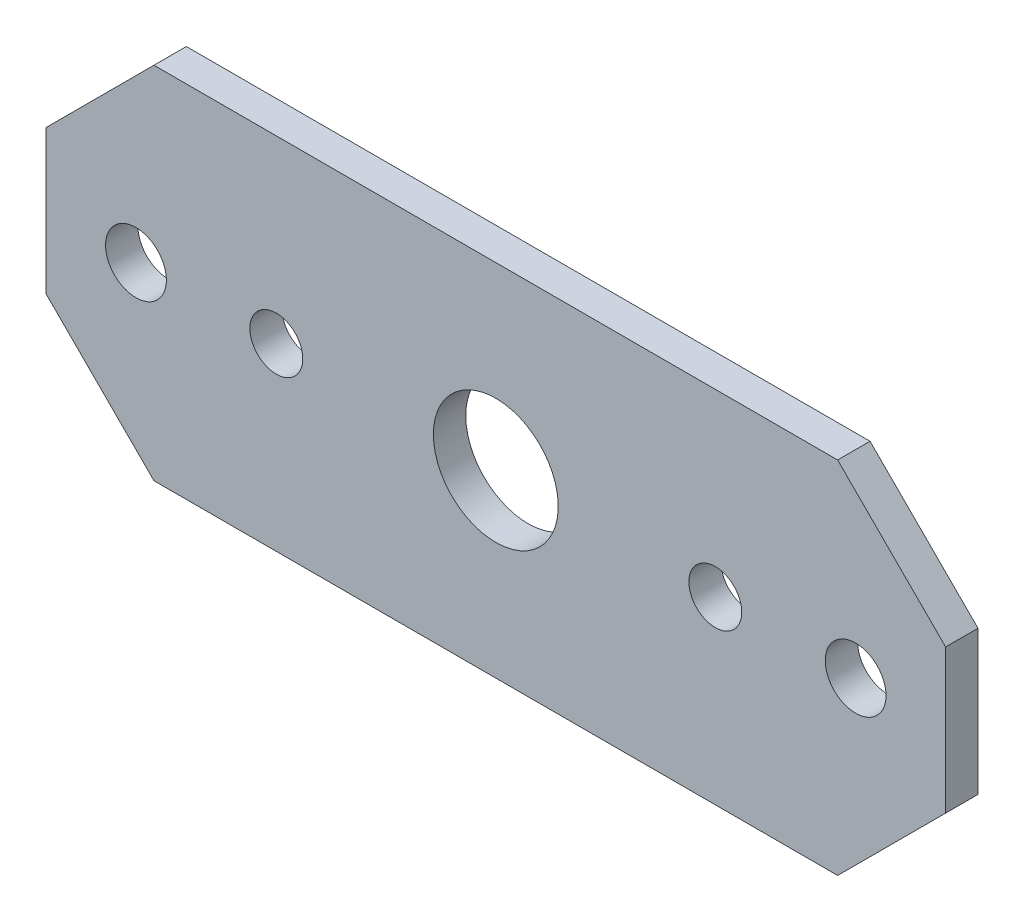
ISO-10303-21;
HEADER;
FILE_DESCRIPTION(('STEP AP214'),'2;1');
FILE_NAME('part.step','',(''),(''),'','','');
FILE_SCHEMA(('AUTOMOTIVE_DESIGN { 1 0 10303 214 1 1 1 1 }'));
ENDSEC;
DATA;
#1=APPLICATION_CONTEXT('core data for automotive mechanical design processes');
#2=APPLICATION_PROTOCOL_DEFINITION('international standard','automotive_design',2000,#1);
#3=PRODUCT_CONTEXT('',#1,'mechanical');
#4=PRODUCT('Part','Part','',(#3));
#5=PRODUCT_RELATED_PRODUCT_CATEGORY('part','',(#4));
#6=PRODUCT_DEFINITION_FORMATION('','',#4);
#7=PRODUCT_DEFINITION_CONTEXT('part definition',#1,'design');
#8=PRODUCT_DEFINITION('design','',#6,#7);
#9=PRODUCT_DEFINITION_SHAPE('','',#8);
#10=(LENGTH_UNIT() NAMED_UNIT(*) SI_UNIT(.MILLI.,.METRE.));
#11=(NAMED_UNIT(*) PLANE_ANGLE_UNIT() SI_UNIT($,.RADIAN.));
#12=(NAMED_UNIT(*) SI_UNIT($,.STERADIAN.) SOLID_ANGLE_UNIT());
#13=UNCERTAINTY_MEASURE_WITH_UNIT(LENGTH_MEASURE(1.E-05),#10,'distance_accuracy_value','');
#14=(GEOMETRIC_REPRESENTATION_CONTEXT(3) GLOBAL_UNCERTAINTY_ASSIGNED_CONTEXT((#13)) GLOBAL_UNIT_ASSIGNED_CONTEXT((#10,
#11,#12)) REPRESENTATION_CONTEXT('',''));
#15=CARTESIAN_POINT('',(0.,0.,0.));
#16=DIRECTION('',(0.,0.,1.));
#17=DIRECTION('',(1.,0.,0.));
#18=AXIS2_PLACEMENT_3D('',#15,#16,#17);
#19=CARTESIAN_POINT('',(-31.75,12.7,-2.286));
#20=DIRECTION('',(0.,0.,-1.));
#21=DIRECTION('',(1.,0.,0.));
#22=AXIS2_PLACEMENT_3D('',#19,#20,#21);
#23=PLANE('',#22);
#24=DIRECTION('',(1.,0.,0.));
#25=VECTOR('',#24,1.);
#26=CARTESIAN_POINT('',(-31.75,12.7,-2.286));
#27=LINE('',#26,#25);
#28=CARTESIAN_POINT('',(24.13,12.7,-2.286));
#29=VERTEX_POINT('',#28);
#30=CARTESIAN_POINT('',(-24.13,12.7,-2.286));
#31=VERTEX_POINT('',#30);
#32=EDGE_CURVE('E258',#29,#31,#27,.F.);
#33=ORIENTED_EDGE('',*,*,#32,.F.);
#34=DIRECTION('',(0.707106781186548,-0.707106781186547,0.));
#35=VECTOR('',#34,1.);
#36=CARTESIAN_POINT('',(24.13,12.7,-2.286));
#37=LINE('',#36,#35);
#38=CARTESIAN_POINT('',(31.75,5.07999999999999,-2.286));
#39=VERTEX_POINT('',#38);
#40=EDGE_CURVE('E124',#39,#29,#37,.F.);
#41=ORIENTED_EDGE('',*,*,#40,.F.);
#42=DIRECTION('',(0.,1.,0.));
#43=VECTOR('',#42,1.);
#44=CARTESIAN_POINT('',(31.75,12.7,-2.286));
#45=LINE('',#44,#43);
#46=CARTESIAN_POINT('',(31.75,-5.07999999999999,-2.286));
#47=VERTEX_POINT('',#46);
#48=EDGE_CURVE('E105',#47,#39,#45,.T.);
#49=ORIENTED_EDGE('',*,*,#48,.F.);
#50=DIRECTION('',(-0.707106781186548,-0.707106781186547,0.));
#51=VECTOR('',#50,1.);
#52=CARTESIAN_POINT('',(31.75,-5.07999999999999,-2.286));
#53=LINE('',#52,#51);
#54=CARTESIAN_POINT('',(24.13,-12.7,-2.286));
#55=VERTEX_POINT('',#54);
#56=EDGE_CURVE('E112',#55,#47,#53,.F.);
#57=ORIENTED_EDGE('',*,*,#56,.F.);
#58=DIRECTION('',(-1.,0.,0.));
#59=VECTOR('',#58,1.);
#60=CARTESIAN_POINT('',(-31.75,-12.7,-2.286));
#61=LINE('',#60,#59);
#62=CARTESIAN_POINT('',(-24.13,-12.7,-2.286));
#63=VERTEX_POINT('',#62);
#64=EDGE_CURVE('E145',#63,#55,#61,.F.);
#65=ORIENTED_EDGE('',*,*,#64,.F.);
#66=DIRECTION('',(-0.707106781186547,0.707106781186548,0.));
#67=VECTOR('',#66,1.);
#68=CARTESIAN_POINT('',(-24.13,-12.7,-2.286));
#69=LINE('',#68,#67);
#70=CARTESIAN_POINT('',(-31.75,-5.08,-2.286));
#71=VERTEX_POINT('',#70);
#72=EDGE_CURVE('E239',#71,#63,#69,.F.);
#73=ORIENTED_EDGE('',*,*,#72,.F.);
#74=DIRECTION('',(0.,1.,0.));
#75=VECTOR('',#74,1.);
#76=CARTESIAN_POINT('',(-31.75,12.7,-2.286));
#77=LINE('',#76,#75);
#78=CARTESIAN_POINT('',(-31.75,5.08,-2.286));
#79=VERTEX_POINT('',#78);
#80=EDGE_CURVE('E248',#79,#71,#77,.F.);
#81=ORIENTED_EDGE('',*,*,#80,.F.);
#82=DIRECTION('',(0.707106781186547,0.707106781186548,0.));
#83=VECTOR('',#82,1.);
#84=CARTESIAN_POINT('',(-31.75,5.08,-2.286));
#85=LINE('',#84,#83);
#86=EDGE_CURVE('E253',#31,#79,#85,.F.);
#87=ORIENTED_EDGE('',*,*,#86,.F.);
#88=EDGE_LOOP('',(#33,#41,#49,#57,#65,#73,#81,#87));
#89=FACE_BOUND('',#88,.T.);
#90=CARTESIAN_POINT('',(0.,0.,-2.286));
#91=DIRECTION('',(0.,0.,-1.));
#92=DIRECTION('',(-1.,0.,0.));
#93=AXIS2_PLACEMENT_3D('',#90,#91,#92);
#94=CIRCLE('',#93,4.4069);
#95=CARTESIAN_POINT('',(-4.4069,0.,-2.286));
#96=VERTEX_POINT('',#95);
#97=EDGE_CURVE('E120',#96,#96,#94,.T.);
#98=ORIENTED_EDGE('',*,*,#97,.F.);
#99=EDGE_LOOP('',(#98));
#100=FACE_BOUND('',#99,.T.);
#101=CARTESIAN_POINT('',(25.4,0.,-2.286));
#102=DIRECTION('',(0.,0.,-1.));
#103=DIRECTION('',(-1.,0.,0.));
#104=AXIS2_PLACEMENT_3D('',#101,#102,#103);
#105=CIRCLE('',#104,2.1463);
#106=CARTESIAN_POINT('',(23.2537,0.,-2.286));
#107=VERTEX_POINT('',#106);
#108=EDGE_CURVE('E148',#107,#107,#105,.T.);
#109=ORIENTED_EDGE('',*,*,#108,.F.);
#110=EDGE_LOOP('',(#109));
#111=FACE_BOUND('',#110,.T.);
#112=CARTESIAN_POINT('',(-25.4,0.,-2.286));
#113=DIRECTION('',(0.,0.,-1.));
#114=DIRECTION('',(-1.,0.,0.));
#115=AXIS2_PLACEMENT_3D('',#112,#113,#114);
#116=CIRCLE('',#115,2.1463);
#117=CARTESIAN_POINT('',(-27.5463,0.,-2.286));
#118=VERTEX_POINT('',#117);
#119=EDGE_CURVE('E151',#118,#118,#116,.T.);
#120=ORIENTED_EDGE('',*,*,#119,.F.);
#121=EDGE_LOOP('',(#120));
#122=FACE_BOUND('',#121,.T.);
#123=CARTESIAN_POINT('',(15.494,0.,-2.286));
#124=DIRECTION('',(0.,0.,-1.));
#125=DIRECTION('',(-1.,0.,0.));
#126=AXIS2_PLACEMENT_3D('',#123,#124,#125);
#127=CIRCLE('',#126,1.8669);
#128=CARTESIAN_POINT('',(13.6271,0.,-2.286));
#129=VERTEX_POINT('',#128);
#130=EDGE_CURVE('E153',#129,#129,#127,.T.);
#131=ORIENTED_EDGE('',*,*,#130,.F.);
#132=EDGE_LOOP('',(#131));
#133=FACE_BOUND('',#132,.T.);
#134=CARTESIAN_POINT('',(-15.494,0.,-2.286));
#135=DIRECTION('',(0.,0.,-1.));
#136=DIRECTION('',(-1.,0.,0.));
#137=AXIS2_PLACEMENT_3D('',#134,#135,#136);
#138=CIRCLE('',#137,1.8669);
#139=CARTESIAN_POINT('',(-17.3609,0.,-2.286));
#140=VERTEX_POINT('',#139);
#141=EDGE_CURVE('E40',#140,#140,#138,.T.);
#142=ORIENTED_EDGE('',*,*,#141,.F.);
#143=EDGE_LOOP('',(#142));
#144=FACE_BOUND('',#143,.T.);
#145=ADVANCED_FACE('F37',(#89,#100,#111,#122,#133,#144),#23,.T.);
#146=CARTESIAN_POINT('',(-15.494,0.,-2.286));
#147=DIRECTION('',(0.,0.,1.));
#148=DIRECTION('',(-1.,0.,0.));
#149=AXIS2_PLACEMENT_3D('',#146,#147,#148);
#150=CYLINDRICAL_SURFACE('',#149,1.8669);
#151=ORIENTED_EDGE('',*,*,#141,.T.);
#152=EDGE_LOOP('',(#151));
#153=FACE_BOUND('',#152,.T.);
#154=CARTESIAN_POINT('',(-15.494,0.,0.));
#155=DIRECTION('',(0.,0.,-1.));
#156=DIRECTION('',(-1.,0.,0.));
#157=AXIS2_PLACEMENT_3D('',#154,#155,#156);
#158=CIRCLE('',#157,1.8669);
#159=CARTESIAN_POINT('',(-17.3609,0.,0.));
#160=VERTEX_POINT('',#159);
#161=EDGE_CURVE('E142',#160,#160,#158,.T.);
#162=ORIENTED_EDGE('',*,*,#161,.F.);
#163=EDGE_LOOP('',(#162));
#164=FACE_BOUND('',#163,.T.);
#165=ADVANCED_FACE('F160',(#153,#164),#150,.F.);
#166=CARTESIAN_POINT('',(15.494,0.,-2.286));
#167=DIRECTION('',(0.,0.,1.));
#168=DIRECTION('',(-1.,0.,0.));
#169=AXIS2_PLACEMENT_3D('',#166,#167,#168);
#170=CYLINDRICAL_SURFACE('',#169,1.8669);
#171=ORIENTED_EDGE('',*,*,#130,.T.);
#172=EDGE_LOOP('',(#171));
#173=FACE_BOUND('',#172,.T.);
#174=CARTESIAN_POINT('',(15.494,0.,0.));
#175=DIRECTION('',(0.,0.,-1.));
#176=DIRECTION('',(-1.,0.,0.));
#177=AXIS2_PLACEMENT_3D('',#174,#175,#176);
#178=CIRCLE('',#177,1.8669);
#179=CARTESIAN_POINT('',(13.6271,0.,0.));
#180=VERTEX_POINT('',#179);
#181=EDGE_CURVE('E139',#180,#180,#178,.T.);
#182=ORIENTED_EDGE('',*,*,#181,.F.);
#183=EDGE_LOOP('',(#182));
#184=FACE_BOUND('',#183,.T.);
#185=ADVANCED_FACE('F167',(#173,#184),#170,.F.);
#186=CARTESIAN_POINT('',(-25.4,0.,-2.286));
#187=DIRECTION('',(0.,0.,1.));
#188=DIRECTION('',(-1.,0.,0.));
#189=AXIS2_PLACEMENT_3D('',#186,#187,#188);
#190=CYLINDRICAL_SURFACE('',#189,2.1463);
#191=ORIENTED_EDGE('',*,*,#119,.T.);
#192=EDGE_LOOP('',(#191));
#193=FACE_BOUND('',#192,.T.);
#194=CARTESIAN_POINT('',(-25.4,0.,0.));
#195=DIRECTION('',(0.,0.,-1.));
#196=DIRECTION('',(-1.,0.,0.));
#197=AXIS2_PLACEMENT_3D('',#194,#195,#196);
#198=CIRCLE('',#197,2.1463);
#199=CARTESIAN_POINT('',(-27.5463,0.,0.));
#200=VERTEX_POINT('',#199);
#201=EDGE_CURVE('E136',#200,#200,#198,.T.);
#202=ORIENTED_EDGE('',*,*,#201,.F.);
#203=EDGE_LOOP('',(#202));
#204=FACE_BOUND('',#203,.T.);
#205=ADVANCED_FACE('F171',(#193,#204),#190,.F.);
#206=CARTESIAN_POINT('',(25.4,0.,-2.286));
#207=DIRECTION('',(0.,0.,1.));
#208=DIRECTION('',(-1.,0.,0.));
#209=AXIS2_PLACEMENT_3D('',#206,#207,#208);
#210=CYLINDRICAL_SURFACE('',#209,2.1463);
#211=ORIENTED_EDGE('',*,*,#108,.T.);
#212=EDGE_LOOP('',(#211));
#213=FACE_BOUND('',#212,.T.);
#214=CARTESIAN_POINT('',(25.4,0.,0.));
#215=DIRECTION('',(0.,0.,-1.));
#216=DIRECTION('',(-1.,0.,0.));
#217=AXIS2_PLACEMENT_3D('',#214,#215,#216);
#218=CIRCLE('',#217,2.1463);
#219=CARTESIAN_POINT('',(23.2537,0.,0.));
#220=VERTEX_POINT('',#219);
#221=EDGE_CURVE('E133',#220,#220,#218,.T.);
#222=ORIENTED_EDGE('',*,*,#221,.F.);
#223=EDGE_LOOP('',(#222));
#224=FACE_BOUND('',#223,.T.);
#225=ADVANCED_FACE('F176',(#213,#224),#210,.F.);
#226=CARTESIAN_POINT('',(0.,0.,-2.286));
#227=DIRECTION('',(0.,0.,1.));
#228=DIRECTION('',(-1.,0.,0.));
#229=AXIS2_PLACEMENT_3D('',#226,#227,#228);
#230=CYLINDRICAL_SURFACE('',#229,4.4069);
#231=ORIENTED_EDGE('',*,*,#97,.T.);
#232=EDGE_LOOP('',(#231));
#233=FACE_BOUND('',#232,.T.);
#234=CARTESIAN_POINT('',(0.,0.,0.));
#235=DIRECTION('',(0.,0.,-1.));
#236=DIRECTION('',(-1.,0.,0.));
#237=AXIS2_PLACEMENT_3D('',#234,#235,#236);
#238=CIRCLE('',#237,4.4069);
#239=CARTESIAN_POINT('',(-4.4069,0.,0.));
#240=VERTEX_POINT('',#239);
#241=EDGE_CURVE('E129',#240,#240,#238,.T.);
#242=ORIENTED_EDGE('',*,*,#241,.F.);
#243=EDGE_LOOP('',(#242));
#244=FACE_BOUND('',#243,.T.);
#245=ADVANCED_FACE('F180',(#233,#244),#230,.F.);
#246=CARTESIAN_POINT('',(31.75,-5.07999999999999,-2.286));
#247=DIRECTION('',(-0.707106781186547,0.707106781186548,0.));
#248=DIRECTION('',(-0.707106781186548,-0.707106781186547,0.));
#249=AXIS2_PLACEMENT_3D('',#246,#247,#248);
#250=PLANE('',#249);
#251=DIRECTION('',(0.,0.,-1.));
#252=VECTOR('',#251,1.);
#253=CARTESIAN_POINT('',(24.13,-12.7,-2.286));
#254=LINE('',#253,#252);
#255=CARTESIAN_POINT('',(24.13,-12.7,0.));
#256=VERTEX_POINT('',#255);
#257=EDGE_CURVE('E116',#55,#256,#254,.F.);
#258=ORIENTED_EDGE('',*,*,#257,.F.);
#259=ORIENTED_EDGE('',*,*,#56,.T.);
#260=DIRECTION('',(0.,0.,-1.));
#261=VECTOR('',#260,1.);
#262=CARTESIAN_POINT('',(31.75,-5.07999999999999,-2.286));
#263=LINE('',#262,#261);
#264=CARTESIAN_POINT('',(31.75,-5.07999999999999,0.));
#265=VERTEX_POINT('',#264);
#266=EDGE_CURVE('E101',#265,#47,#263,.T.);
#267=ORIENTED_EDGE('',*,*,#266,.F.);
#268=DIRECTION('',(0.707106781186548,0.707106781186547,0.));
#269=VECTOR('',#268,1.);
#270=CARTESIAN_POINT('',(24.13,-12.7,0.));
#271=LINE('',#270,#269);
#272=EDGE_CURVE('E132',#256,#265,#271,.T.);
#273=ORIENTED_EDGE('',*,*,#272,.F.);
#274=EDGE_LOOP('',(#258,#259,#267,#273));
#275=FACE_BOUND('',#274,.T.);
#276=ADVANCED_FACE('F115',(#275),#250,.F.);
#277=CARTESIAN_POINT('',(31.75,12.7,-2.286));
#278=DIRECTION('',(-1.,0.,0.));
#279=DIRECTION('',(0.,0.,-1.));
#280=AXIS2_PLACEMENT_3D('',#277,#278,#279);
#281=PLANE('',#280);
#282=ORIENTED_EDGE('',*,*,#266,.T.);
#283=ORIENTED_EDGE('',*,*,#48,.T.);
#284=DIRECTION('',(0.,0.,-1.));
#285=VECTOR('',#284,1.);
#286=CARTESIAN_POINT('',(31.75,5.08,-2.286));
#287=LINE('',#286,#285);
#288=CARTESIAN_POINT('',(31.75,5.08,0.));
#289=VERTEX_POINT('',#288);
#290=EDGE_CURVE('E96',#289,#39,#287,.T.);
#291=ORIENTED_EDGE('',*,*,#290,.F.);
#292=DIRECTION('',(0.,1.,0.));
#293=VECTOR('',#292,1.);
#294=CARTESIAN_POINT('',(31.75,12.7,0.));
#295=LINE('',#294,#293);
#296=EDGE_CURVE('E108',#265,#289,#295,.T.);
#297=ORIENTED_EDGE('',*,*,#296,.F.);
#298=EDGE_LOOP('',(#282,#283,#291,#297));
#299=FACE_BOUND('',#298,.T.);
#300=ADVANCED_FACE('F103',(#299),#281,.F.);
#301=CARTESIAN_POINT('',(24.13,12.7,-2.286));
#302=DIRECTION('',(-0.707106781186547,-0.707106781186548,0.));
#303=DIRECTION('',(0.707106781186548,-0.707106781186547,0.));
#304=AXIS2_PLACEMENT_3D('',#301,#302,#303);
#305=PLANE('',#304);
#306=ORIENTED_EDGE('',*,*,#290,.T.);
#307=ORIENTED_EDGE('',*,*,#40,.T.);
#308=DIRECTION('',(0.,0.,1.));
#309=VECTOR('',#308,1.);
#310=CARTESIAN_POINT('',(24.13,12.7,-2.286));
#311=LINE('',#310,#309);
#312=CARTESIAN_POINT('',(24.13,12.7,0.));
#313=VERTEX_POINT('',#312);
#314=EDGE_CURVE('E261',#313,#29,#311,.F.);
#315=ORIENTED_EDGE('',*,*,#314,.F.);
#316=DIRECTION('',(-0.707106781186548,0.707106781186547,0.));
#317=VECTOR('',#316,1.);
#318=CARTESIAN_POINT('',(31.75,5.08,0.));
#319=LINE('',#318,#317);
#320=EDGE_CURVE('E270',#289,#313,#319,.T.);
#321=ORIENTED_EDGE('',*,*,#320,.F.);
#322=EDGE_LOOP('',(#306,#307,#315,#321));
#323=FACE_BOUND('',#322,.T.);
#324=ADVANCED_FACE('F189',(#323),#305,.F.);
#325=CARTESIAN_POINT('',(-31.75,12.7,-2.286));
#326=DIRECTION('',(0.,-1.,0.));
#327=DIRECTION('',(0.,0.,1.));
#328=AXIS2_PLACEMENT_3D('',#325,#326,#327);
#329=PLANE('',#328);
#330=ORIENTED_EDGE('',*,*,#314,.T.);
#331=ORIENTED_EDGE('',*,*,#32,.T.);
#332=DIRECTION('',(0.,0.,-1.));
#333=VECTOR('',#332,1.);
#334=CARTESIAN_POINT('',(-24.13,12.7,-2.286));
#335=LINE('',#334,#333);
#336=CARTESIAN_POINT('',(-24.13,12.7,0.));
#337=VERTEX_POINT('',#336);
#338=EDGE_CURVE('E256',#337,#31,#335,.T.);
#339=ORIENTED_EDGE('',*,*,#338,.F.);
#340=DIRECTION('',(1.,0.,0.));
#341=VECTOR('',#340,1.);
#342=CARTESIAN_POINT('',(-31.75,12.7,0.));
#343=LINE('',#342,#341);
#344=EDGE_CURVE('E267',#313,#337,#343,.F.);
#345=ORIENTED_EDGE('',*,*,#344,.F.);
#346=EDGE_LOOP('',(#330,#331,#339,#345));
#347=FACE_BOUND('',#346,.T.);
#348=ADVANCED_FACE('F192',(#347),#329,.F.);
#349=CARTESIAN_POINT('',(-31.75,5.08,-2.286));
#350=DIRECTION('',(0.707106781186548,-0.707106781186547,0.));
#351=DIRECTION('',(0.707106781186547,0.707106781186548,0.));
#352=AXIS2_PLACEMENT_3D('',#349,#350,#351);
#353=PLANE('',#352);
#354=ORIENTED_EDGE('',*,*,#338,.T.);
#355=ORIENTED_EDGE('',*,*,#86,.T.);
#356=DIRECTION('',(0.,0.,1.));
#357=VECTOR('',#356,1.);
#358=CARTESIAN_POINT('',(-31.75,5.08,-2.286));
#359=LINE('',#358,#357);
#360=CARTESIAN_POINT('',(-31.75,5.08,0.));
#361=VERTEX_POINT('',#360);
#362=EDGE_CURVE('E251',#361,#79,#359,.F.);
#363=ORIENTED_EDGE('',*,*,#362,.F.);
#364=DIRECTION('',(-0.707106781186547,-0.707106781186548,0.));
#365=VECTOR('',#364,1.);
#366=CARTESIAN_POINT('',(-24.13,12.7,0.));
#367=LINE('',#366,#365);
#368=EDGE_CURVE('E269',#337,#361,#367,.T.);
#369=ORIENTED_EDGE('',*,*,#368,.F.);
#370=EDGE_LOOP('',(#354,#355,#363,#369));
#371=FACE_BOUND('',#370,.T.);
#372=ADVANCED_FACE('F195',(#371),#353,.F.);
#373=CARTESIAN_POINT('',(-31.75,12.7,-2.286));
#374=DIRECTION('',(1.,0.,0.));
#375=DIRECTION('',(0.,0.,1.));
#376=AXIS2_PLACEMENT_3D('',#373,#374,#375);
#377=PLANE('',#376);
#378=DIRECTION('',(0.,0.,-1.));
#379=VECTOR('',#378,1.);
#380=CARTESIAN_POINT('',(-31.75,-5.08,-2.286));
#381=LINE('',#380,#379);
#382=CARTESIAN_POINT('',(-31.75,-5.08,0.));
#383=VERTEX_POINT('',#382);
#384=EDGE_CURVE('E246',#383,#71,#381,.T.);
#385=ORIENTED_EDGE('',*,*,#384,.F.);
#386=DIRECTION('',(0.,1.,0.));
#387=VECTOR('',#386,1.);
#388=CARTESIAN_POINT('',(-31.75,12.7,0.));
#389=LINE('',#388,#387);
#390=EDGE_CURVE('E233',#361,#383,#389,.F.);
#391=ORIENTED_EDGE('',*,*,#390,.F.);
#392=ORIENTED_EDGE('',*,*,#362,.T.);
#393=ORIENTED_EDGE('',*,*,#80,.T.);
#394=EDGE_LOOP('',(#385,#391,#392,#393));
#395=FACE_BOUND('',#394,.T.);
#396=ADVANCED_FACE('F199',(#395),#377,.F.);
#397=CARTESIAN_POINT('',(-24.13,-12.7,-2.286));
#398=DIRECTION('',(0.707106781186548,0.707106781186547,0.));
#399=DIRECTION('',(-0.707106781186547,0.707106781186548,0.));
#400=AXIS2_PLACEMENT_3D('',#397,#398,#399);
#401=PLANE('',#400);
#402=ORIENTED_EDGE('',*,*,#384,.T.);
#403=ORIENTED_EDGE('',*,*,#72,.T.);
#404=DIRECTION('',(0.,0.,-1.));
#405=VECTOR('',#404,1.);
#406=CARTESIAN_POINT('',(-24.13,-12.7,-2.286));
#407=LINE('',#406,#405);
#408=CARTESIAN_POINT('',(-24.13,-12.7,0.));
#409=VERTEX_POINT('',#408);
#410=EDGE_CURVE('E237',#409,#63,#407,.T.);
#411=ORIENTED_EDGE('',*,*,#410,.F.);
#412=DIRECTION('',(0.707106781186547,-0.707106781186548,0.));
#413=VECTOR('',#412,1.);
#414=CARTESIAN_POINT('',(-31.75,-5.08,0.));
#415=LINE('',#414,#413);
#416=EDGE_CURVE('E46',#383,#409,#415,.T.);
#417=ORIENTED_EDGE('',*,*,#416,.F.);
#418=EDGE_LOOP('',(#402,#403,#411,#417));
#419=FACE_BOUND('',#418,.T.);
#420=ADVANCED_FACE('F203',(#419),#401,.F.);
#421=CARTESIAN_POINT('',(-31.75,-12.7,-2.286));
#422=DIRECTION('',(0.,1.,0.));
#423=DIRECTION('',(-1.,0.,0.));
#424=AXIS2_PLACEMENT_3D('',#421,#422,#423);
#425=PLANE('',#424);
#426=ORIENTED_EDGE('',*,*,#410,.T.);
#427=ORIENTED_EDGE('',*,*,#64,.T.);
#428=ORIENTED_EDGE('',*,*,#257,.T.);
#429=DIRECTION('',(1.,0.,0.));
#430=VECTOR('',#429,1.);
#431=CARTESIAN_POINT('',(-31.75,-12.7,0.));
#432=LINE('',#431,#430);
#433=EDGE_CURVE('E11',#409,#256,#432,.T.);
#434=ORIENTED_EDGE('',*,*,#433,.F.);
#435=EDGE_LOOP('',(#426,#427,#428,#434));
#436=FACE_BOUND('',#435,.T.);
#437=ADVANCED_FACE('F207',(#436),#425,.F.);
#438=CARTESIAN_POINT('',(-31.75,12.7,0.));
#439=DIRECTION('',(0.,0.,-1.));
#440=DIRECTION('',(1.,0.,0.));
#441=AXIS2_PLACEMENT_3D('',#438,#439,#440);
#442=PLANE('',#441);
#443=ORIENTED_EDGE('',*,*,#416,.T.);
#444=ORIENTED_EDGE('',*,*,#433,.T.);
#445=ORIENTED_EDGE('',*,*,#272,.T.);
#446=ORIENTED_EDGE('',*,*,#296,.T.);
#447=ORIENTED_EDGE('',*,*,#320,.T.);
#448=ORIENTED_EDGE('',*,*,#344,.T.);
#449=ORIENTED_EDGE('',*,*,#368,.T.);
#450=ORIENTED_EDGE('',*,*,#390,.T.);
#451=EDGE_LOOP('',(#443,#444,#445,#446,#447,#448,#449,#450));
#452=FACE_BOUND('',#451,.T.);
#453=ORIENTED_EDGE('',*,*,#241,.T.);
#454=EDGE_LOOP('',(#453));
#455=FACE_BOUND('',#454,.T.);
#456=ORIENTED_EDGE('',*,*,#221,.T.);
#457=EDGE_LOOP('',(#456));
#458=FACE_BOUND('',#457,.T.);
#459=ORIENTED_EDGE('',*,*,#201,.T.);
#460=EDGE_LOOP('',(#459));
#461=FACE_BOUND('',#460,.T.);
#462=ORIENTED_EDGE('',*,*,#181,.T.);
#463=EDGE_LOOP('',(#462));
#464=FACE_BOUND('',#463,.T.);
#465=ORIENTED_EDGE('',*,*,#161,.T.);
#466=EDGE_LOOP('',(#465));
#467=FACE_BOUND('',#466,.T.);
#468=ADVANCED_FACE('F211',(#452,#455,#458,#461,#464,#467),#442,.F.);
#469=CLOSED_SHELL('',(#145,#165,#185,#205,#225,#245,#276,#300,#324,#348,#372,#396,#420,#437,#468));
#470=MANIFOLD_SOLID_BREP('B2',#469);
#471=ADVANCED_BREP_SHAPE_REPRESENTATION('',(#18,#470),#14);
#472=SHAPE_DEFINITION_REPRESENTATION(#9,#471);
ENDSEC;
END-ISO-10303-21;
